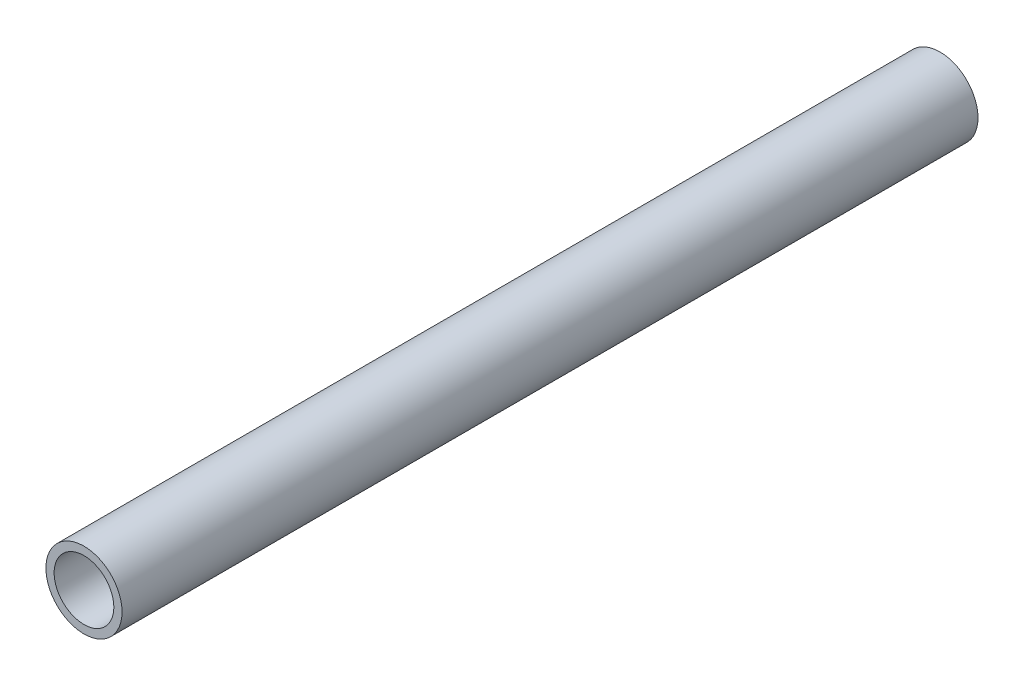
ISO-10303-21;
HEADER;
FILE_DESCRIPTION(('STEP AP214'),'2;1');
FILE_NAME('part.step','',(''),(''),'','','');
FILE_SCHEMA(('AUTOMOTIVE_DESIGN { 1 0 10303 214 1 1 1 1 }'));
ENDSEC;
DATA;
#1=APPLICATION_CONTEXT('core data for automotive mechanical design processes');
#2=APPLICATION_PROTOCOL_DEFINITION('international standard','automotive_design',2000,#1);
#3=PRODUCT_CONTEXT('',#1,'mechanical');
#4=PRODUCT('Part','Part','',(#3));
#5=PRODUCT_RELATED_PRODUCT_CATEGORY('part','',(#4));
#6=PRODUCT_DEFINITION_FORMATION('','',#4);
#7=PRODUCT_DEFINITION_CONTEXT('part definition',#1,'design');
#8=PRODUCT_DEFINITION('design','',#6,#7);
#9=PRODUCT_DEFINITION_SHAPE('','',#8);
#10=(LENGTH_UNIT() NAMED_UNIT(*) SI_UNIT(.MILLI.,.METRE.));
#11=(NAMED_UNIT(*) PLANE_ANGLE_UNIT() SI_UNIT($,.RADIAN.));
#12=(NAMED_UNIT(*) SI_UNIT($,.STERADIAN.) SOLID_ANGLE_UNIT());
#13=UNCERTAINTY_MEASURE_WITH_UNIT(LENGTH_MEASURE(1.E-05),#10,'distance_accuracy_value','');
#14=(GEOMETRIC_REPRESENTATION_CONTEXT(3) GLOBAL_UNCERTAINTY_ASSIGNED_CONTEXT((#13)) GLOBAL_UNIT_ASSIGNED_CONTEXT((#10,
#11,#12)) REPRESENTATION_CONTEXT('',''));
#15=CARTESIAN_POINT('',(0.,0.,0.));
#16=DIRECTION('',(0.,0.,1.));
#17=DIRECTION('',(1.,0.,0.));
#18=AXIS2_PLACEMENT_3D('',#15,#16,#17);
#19=CARTESIAN_POINT('',(0.,0.,150.));
#20=DIRECTION('',(0.,0.,1.));
#21=DIRECTION('',(1.,0.,0.));
#22=AXIS2_PLACEMENT_3D('',#19,#20,#21);
#23=PLANE('',#22);
#24=CARTESIAN_POINT('',(0.,0.,150.));
#25=DIRECTION('',(0.,0.,1.));
#26=DIRECTION('',(1.,0.,0.));
#27=AXIS2_PLACEMENT_3D('',#24,#25,#26);
#28=CIRCLE('',#27,13.335);
#29=CARTESIAN_POINT('',(13.335,0.,150.));
#30=VERTEX_POINT('',#29);
#31=EDGE_CURVE('E11',#30,#30,#28,.T.);
#32=ORIENTED_EDGE('',*,*,#31,.T.);
#33=EDGE_LOOP('',(#32));
#34=FACE_BOUND('',#33,.T.);
#35=CARTESIAN_POINT('',(0.,0.,150.));
#36=DIRECTION('',(0.,0.,1.));
#37=DIRECTION('',(1.,0.,0.));
#38=AXIS2_PLACEMENT_3D('',#35,#36,#37);
#39=CIRCLE('',#38,10.4648);
#40=CARTESIAN_POINT('',(10.4648,0.,150.));
#41=VERTEX_POINT('',#40);
#42=EDGE_CURVE('E48',#41,#41,#39,.T.);
#43=ORIENTED_EDGE('',*,*,#42,.F.);
#44=EDGE_LOOP('',(#43));
#45=FACE_BOUND('',#44,.T.);
#46=ADVANCED_FACE('F37',(#34,#45),#23,.T.);
#47=CARTESIAN_POINT('',(0.,0.,-150.));
#48=DIRECTION('',(0.,0.,1.));
#49=DIRECTION('',(1.,0.,0.));
#50=AXIS2_PLACEMENT_3D('',#47,#48,#49);
#51=PLANE('',#50);
#52=CARTESIAN_POINT('',(0.,0.,-150.));
#53=DIRECTION('',(0.,0.,1.));
#54=DIRECTION('',(1.,0.,0.));
#55=AXIS2_PLACEMENT_3D('',#52,#53,#54);
#56=CIRCLE('',#55,13.335);
#57=CARTESIAN_POINT('',(13.335,0.,-150.));
#58=VERTEX_POINT('',#57);
#59=EDGE_CURVE('E41',#58,#58,#56,.T.);
#60=ORIENTED_EDGE('',*,*,#59,.F.);
#61=EDGE_LOOP('',(#60));
#62=FACE_BOUND('',#61,.T.);
#63=CARTESIAN_POINT('',(0.,0.,-150.));
#64=DIRECTION('',(0.,0.,1.));
#65=DIRECTION('',(1.,0.,0.));
#66=AXIS2_PLACEMENT_3D('',#63,#64,#65);
#67=CIRCLE('',#66,10.4648);
#68=CARTESIAN_POINT('',(10.4648,0.,-150.));
#69=VERTEX_POINT('',#68);
#70=EDGE_CURVE('E50',#69,#69,#67,.T.);
#71=ORIENTED_EDGE('',*,*,#70,.T.);
#72=EDGE_LOOP('',(#71));
#73=FACE_BOUND('',#72,.T.);
#74=ADVANCED_FACE('F60',(#62,#73),#51,.F.);
#75=CARTESIAN_POINT('',(0.,0.,150.));
#76=DIRECTION('',(0.,0.,-1.));
#77=DIRECTION('',(-1.,0.,0.));
#78=AXIS2_PLACEMENT_3D('',#75,#76,#77);
#79=CYLINDRICAL_SURFACE('',#78,13.335);
#80=ORIENTED_EDGE('',*,*,#31,.F.);
#81=EDGE_LOOP('',(#80));
#82=FACE_BOUND('',#81,.T.);
#83=ORIENTED_EDGE('',*,*,#59,.T.);
#84=EDGE_LOOP('',(#83));
#85=FACE_BOUND('',#84,.T.);
#86=ADVANCED_FACE('F39',(#82,#85),#79,.T.);
#87=CARTESIAN_POINT('',(0.,0.,150.));
#88=DIRECTION('',(0.,0.,-1.));
#89=DIRECTION('',(-1.,0.,0.));
#90=AXIS2_PLACEMENT_3D('',#87,#88,#89);
#91=CYLINDRICAL_SURFACE('',#90,10.4648);
#92=ORIENTED_EDGE('',*,*,#42,.T.);
#93=EDGE_LOOP('',(#92));
#94=FACE_BOUND('',#93,.T.);
#95=ORIENTED_EDGE('',*,*,#70,.F.);
#96=EDGE_LOOP('',(#95));
#97=FACE_BOUND('',#96,.T.);
#98=ADVANCED_FACE('F56',(#94,#97),#91,.F.);
#99=CLOSED_SHELL('',(#46,#74,#86,#98));
#100=MANIFOLD_SOLID_BREP('B2',#99);
#101=ADVANCED_BREP_SHAPE_REPRESENTATION('',(#18,#100),#14);
#102=SHAPE_DEFINITION_REPRESENTATION(#9,#101);
ENDSEC;
END-ISO-10303-21;
